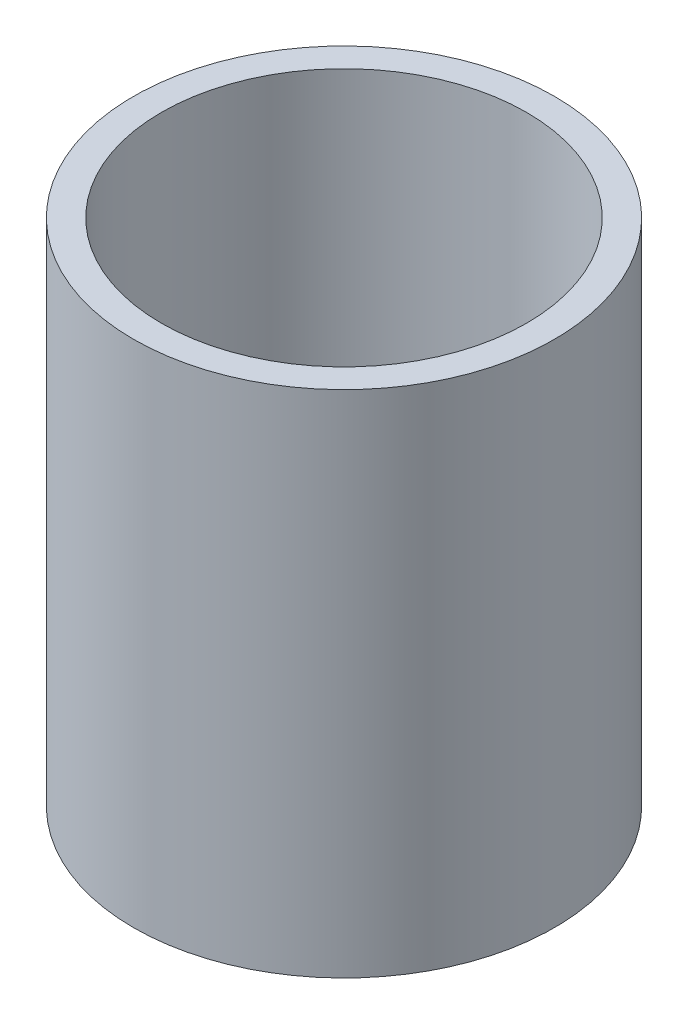
ISO-10303-21;
HEADER;
FILE_DESCRIPTION(('STEP AP214'),'2;1');
FILE_NAME('part.step','',(''),(''),'','','');
FILE_SCHEMA(('AUTOMOTIVE_DESIGN { 1 0 10303 214 1 1 1 1 }'));
ENDSEC;
DATA;
#1=APPLICATION_CONTEXT('core data for automotive mechanical design processes');
#2=APPLICATION_PROTOCOL_DEFINITION('international standard','automotive_design',2000,#1);
#3=PRODUCT_CONTEXT('',#1,'mechanical');
#4=PRODUCT('Part','Part','',(#3));
#5=PRODUCT_RELATED_PRODUCT_CATEGORY('part','',(#4));
#6=PRODUCT_DEFINITION_FORMATION('','',#4);
#7=PRODUCT_DEFINITION_CONTEXT('part definition',#1,'design');
#8=PRODUCT_DEFINITION('design','',#6,#7);
#9=PRODUCT_DEFINITION_SHAPE('','',#8);
#10=(LENGTH_UNIT() NAMED_UNIT(*) SI_UNIT(.MILLI.,.METRE.));
#11=(NAMED_UNIT(*) PLANE_ANGLE_UNIT() SI_UNIT($,.RADIAN.));
#12=(NAMED_UNIT(*) SI_UNIT($,.STERADIAN.) SOLID_ANGLE_UNIT());
#13=UNCERTAINTY_MEASURE_WITH_UNIT(LENGTH_MEASURE(1.E-05),#10,'distance_accuracy_value','');
#14=(GEOMETRIC_REPRESENTATION_CONTEXT(3) GLOBAL_UNCERTAINTY_ASSIGNED_CONTEXT((#13)) GLOBAL_UNIT_ASSIGNED_CONTEXT((#10,
#11,#12)) REPRESENTATION_CONTEXT('',''));
#15=CARTESIAN_POINT('',(0.,0.,0.));
#16=DIRECTION('',(0.,0.,1.));
#17=DIRECTION('',(1.,0.,0.));
#18=AXIS2_PLACEMENT_3D('',#15,#16,#17);
#19=CARTESIAN_POINT('',(0.,108.952865676542,0.));
#20=DIRECTION('',(0.,-1.,0.));
#21=DIRECTION('',(0.,0.,-1.));
#22=AXIS2_PLACEMENT_3D('',#19,#20,#21);
#23=CYLINDRICAL_SURFACE('',#22,45.);
#24=CARTESIAN_POINT('',(0.,108.952865676542,0.));
#25=DIRECTION('',(0.,1.,0.));
#26=DIRECTION('',(0.,0.,1.));
#27=AXIS2_PLACEMENT_3D('',#24,#25,#26);
#28=CIRCLE('',#27,45.);
#29=CARTESIAN_POINT('',(0.,108.952865676542,45.));
#30=VERTEX_POINT('',#29);
#31=EDGE_CURVE('E10',#30,#30,#28,.T.);
#32=ORIENTED_EDGE('',*,*,#31,.F.);
#33=EDGE_LOOP('',(#32));
#34=FACE_BOUND('',#33,.T.);
#35=CARTESIAN_POINT('',(0.,0.,0.));
#36=DIRECTION('',(0.,1.,0.));
#37=DIRECTION('',(0.,0.,1.));
#38=AXIS2_PLACEMENT_3D('',#35,#36,#37);
#39=CIRCLE('',#38,45.);
#40=CARTESIAN_POINT('',(0.,0.,45.));
#41=VERTEX_POINT('',#40);
#42=EDGE_CURVE('E37',#41,#41,#39,.T.);
#43=ORIENTED_EDGE('',*,*,#42,.T.);
#44=EDGE_LOOP('',(#43));
#45=FACE_BOUND('',#44,.T.);
#46=ADVANCED_FACE('F40',(#34,#45),#23,.T.);
#47=CARTESIAN_POINT('',(0.,108.952865676542,0.));
#48=DIRECTION('',(0.,1.,0.));
#49=DIRECTION('',(0.,0.,1.));
#50=AXIS2_PLACEMENT_3D('',#47,#48,#49);
#51=PLANE('',#50);
#52=CARTESIAN_POINT('',(0.,108.952865676542,0.));
#53=DIRECTION('',(0.,1.,0.));
#54=DIRECTION('',(0.,0.,1.));
#55=AXIS2_PLACEMENT_3D('',#52,#53,#54);
#56=CIRCLE('',#55,39.049895175385);
#57=CARTESIAN_POINT('',(0.,108.952865676542,39.049895175385));
#58=VERTEX_POINT('',#57);
#59=EDGE_CURVE('E50',#58,#58,#56,.T.);
#60=ORIENTED_EDGE('',*,*,#59,.F.);
#61=EDGE_LOOP('',(#60));
#62=FACE_BOUND('',#61,.T.);
#63=ORIENTED_EDGE('',*,*,#31,.T.);
#64=EDGE_LOOP('',(#63));
#65=FACE_BOUND('',#64,.T.);
#66=ADVANCED_FACE('F59',(#62,#65),#51,.T.);
#67=CARTESIAN_POINT('',(0.,0.,0.));
#68=DIRECTION('',(0.,1.,0.));
#69=DIRECTION('',(0.,0.,1.));
#70=AXIS2_PLACEMENT_3D('',#67,#68,#69);
#71=PLANE('',#70);
#72=CARTESIAN_POINT('',(0.,0.,0.));
#73=DIRECTION('',(0.,1.,0.));
#74=DIRECTION('',(0.,0.,1.));
#75=AXIS2_PLACEMENT_3D('',#72,#73,#74);
#76=CIRCLE('',#75,39.049895175385);
#77=CARTESIAN_POINT('',(0.,0.,39.049895175385));
#78=VERTEX_POINT('',#77);
#79=EDGE_CURVE('E47',#78,#78,#76,.T.);
#80=ORIENTED_EDGE('',*,*,#79,.T.);
#81=EDGE_LOOP('',(#80));
#82=FACE_BOUND('',#81,.T.);
#83=ORIENTED_EDGE('',*,*,#42,.F.);
#84=EDGE_LOOP('',(#83));
#85=FACE_BOUND('',#84,.T.);
#86=ADVANCED_FACE('F58',(#82,#85),#71,.F.);
#87=CARTESIAN_POINT('',(0.,108.952865676542,0.));
#88=DIRECTION('',(0.,-1.,0.));
#89=DIRECTION('',(0.,0.,-1.));
#90=AXIS2_PLACEMENT_3D('',#87,#88,#89);
#91=CYLINDRICAL_SURFACE('',#90,39.049895175385);
#92=ORIENTED_EDGE('',*,*,#59,.T.);
#93=EDGE_LOOP('',(#92));
#94=FACE_BOUND('',#93,.T.);
#95=ORIENTED_EDGE('',*,*,#79,.F.);
#96=EDGE_LOOP('',(#95));
#97=FACE_BOUND('',#96,.T.);
#98=ADVANCED_FACE('F54',(#94,#97),#91,.F.);
#99=CLOSED_SHELL('',(#46,#66,#86,#98));
#100=MANIFOLD_SOLID_BREP('B2',#99);
#101=ADVANCED_BREP_SHAPE_REPRESENTATION('',(#18,#100),#14);
#102=SHAPE_DEFINITION_REPRESENTATION(#9,#101);
ENDSEC;
END-ISO-10303-21;
